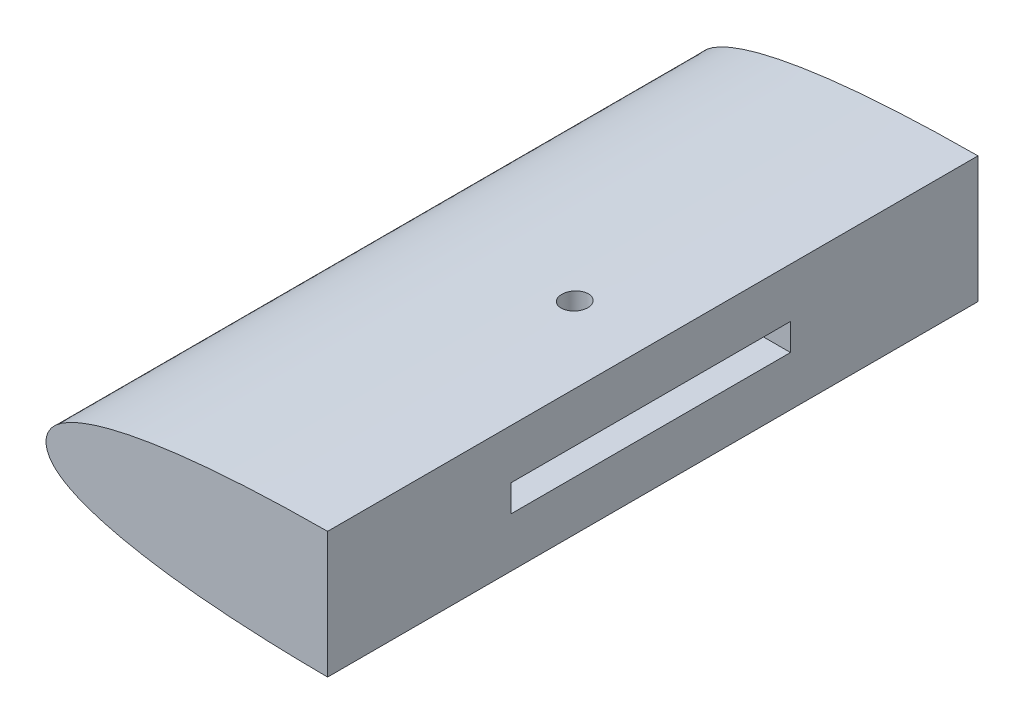
ISO-10303-21;
HEADER;
FILE_DESCRIPTION(('STEP AP214'),'2;1');
FILE_NAME('part.step','',(''),(''),'','','');
FILE_SCHEMA(('AUTOMOTIVE_DESIGN { 1 0 10303 214 1 1 1 1 }'));
ENDSEC;
DATA;
#1=APPLICATION_CONTEXT('core data for automotive mechanical design processes');
#2=APPLICATION_PROTOCOL_DEFINITION('international standard','automotive_design',2000,#1);
#3=PRODUCT_CONTEXT('',#1,'mechanical');
#4=PRODUCT('Part','Part','',(#3));
#5=PRODUCT_RELATED_PRODUCT_CATEGORY('part','',(#4));
#6=PRODUCT_DEFINITION_FORMATION('','',#4);
#7=PRODUCT_DEFINITION_CONTEXT('part definition',#1,'design');
#8=PRODUCT_DEFINITION('design','',#6,#7);
#9=PRODUCT_DEFINITION_SHAPE('','',#8);
#10=(LENGTH_UNIT() NAMED_UNIT(*) SI_UNIT(.MILLI.,.METRE.));
#11=(NAMED_UNIT(*) PLANE_ANGLE_UNIT() SI_UNIT($,.RADIAN.));
#12=(NAMED_UNIT(*) SI_UNIT($,.STERADIAN.) SOLID_ANGLE_UNIT());
#13=UNCERTAINTY_MEASURE_WITH_UNIT(LENGTH_MEASURE(1.E-05),#10,'distance_accuracy_value','');
#14=(GEOMETRIC_REPRESENTATION_CONTEXT(3) GLOBAL_UNCERTAINTY_ASSIGNED_CONTEXT((#13)) GLOBAL_UNIT_ASSIGNED_CONTEXT((#10,
#11,#12)) REPRESENTATION_CONTEXT('',''));
#15=CARTESIAN_POINT('',(0.,0.,0.));
#16=DIRECTION('',(0.,0.,1.));
#17=DIRECTION('',(1.,0.,0.));
#18=AXIS2_PLACEMENT_3D('',#15,#16,#17);
#19=CARTESIAN_POINT('',(30.9490601417906,3.10353900169913,106.75));
#20=DIRECTION('',(0.,1.,0.));
#21=DIRECTION('',(0.,0.,1.));
#22=AXIS2_PLACEMENT_3D('',#19,#20,#21);
#23=PLANE('',#22);
#24=CARTESIAN_POINT('',(46.9490601417906,3.10353900169913,75.));
#25=DIRECTION('',(0.,1.,0.));
#26=DIRECTION('',(0.,0.,1.));
#27=AXIS2_PLACEMENT_3D('',#24,#25,#26);
#28=CIRCLE('',#27,3.);
#29=CARTESIAN_POINT('',(46.9490601417906,3.10353900169913,78.));
#30=VERTEX_POINT('',#29);
#31=EDGE_CURVE('E140',#30,#30,#28,.T.);
#32=ORIENTED_EDGE('',*,*,#31,.T.);
#33=EDGE_LOOP('',(#32));
#34=FACE_BOUND('',#33,.T.);
#35=DIRECTION('',(0.,0.,1.));
#36=VECTOR('',#35,1.);
#37=CARTESIAN_POINT('',(64.9490601417906,3.10353900169913,106.75));
#38=LINE('',#37,#36);
#39=CARTESIAN_POINT('',(64.9490601417906,3.10353900169913,43.25));
#40=VERTEX_POINT('',#39);
#41=CARTESIAN_POINT('',(64.9490601417906,3.10353900169913,107.75));
#42=VERTEX_POINT('',#41);
#43=EDGE_CURVE('E154',#40,#42,#38,.T.);
#44=ORIENTED_EDGE('',*,*,#43,.T.);
#45=DIRECTION('',(1.,0.,0.));
#46=VECTOR('',#45,1.);
#47=CARTESIAN_POINT('',(64.9490601417906,3.10353900169913,107.75));
#48=LINE('',#47,#46);
#49=CARTESIAN_POINT('',(37.9490601417906,3.10353900169913,107.75));
#50=VERTEX_POINT('',#49);
#51=EDGE_CURVE('E127',#50,#42,#48,.T.);
#52=ORIENTED_EDGE('',*,*,#51,.F.);
#53=DIRECTION('',(0.,0.,1.));
#54=VECTOR('',#53,1.);
#55=CARTESIAN_POINT('',(37.9490601417906,3.10353900169913,106.75));
#56=LINE('',#55,#54);
#57=CARTESIAN_POINT('',(37.9490601417906,3.10353900169913,43.25));
#58=VERTEX_POINT('',#57);
#59=EDGE_CURVE('E111',#58,#50,#56,.T.);
#60=ORIENTED_EDGE('',*,*,#59,.F.);
#61=DIRECTION('',(1.,0.,0.));
#62=VECTOR('',#61,1.);
#63=CARTESIAN_POINT('',(30.9490601417906,3.10353900169913,43.25));
#64=LINE('',#63,#62);
#65=EDGE_CURVE('E158',#58,#40,#64,.T.);
#66=ORIENTED_EDGE('',*,*,#65,.T.);
#67=EDGE_LOOP('',(#44,#52,#60,#66));
#68=FACE_BOUND('',#67,.T.);
#69=ADVANCED_FACE('F42',(#34,#68),#23,.F.);
#70=CARTESIAN_POINT('',(30.9490601417906,3.10353900169913,43.25));
#71=DIRECTION('',(0.,0.,-1.));
#72=DIRECTION('',(-1.,0.,0.));
#73=AXIS2_PLACEMENT_3D('',#70,#71,#72);
#74=PLANE('',#73);
#75=ORIENTED_EDGE('',*,*,#65,.F.);
#76=DIRECTION('',(0.,1.,0.));
#77=VECTOR('',#76,1.);
#78=CARTESIAN_POINT('',(37.9490601417906,3.10353900169913,43.25));
#79=LINE('',#78,#77);
#80=CARTESIAN_POINT('',(37.9490601417906,-3.10353900169913,43.25));
#81=VERTEX_POINT('',#80);
#82=EDGE_CURVE('E146',#81,#58,#79,.T.);
#83=ORIENTED_EDGE('',*,*,#82,.F.);
#84=DIRECTION('',(1.,0.,0.));
#85=VECTOR('',#84,1.);
#86=CARTESIAN_POINT('',(30.9490601417906,-3.10353900169913,43.25));
#87=LINE('',#86,#85);
#88=CARTESIAN_POINT('',(64.9490601417906,-3.10353900169913,43.25));
#89=VERTEX_POINT('',#88);
#90=EDGE_CURVE('E157',#81,#89,#87,.T.);
#91=ORIENTED_EDGE('',*,*,#90,.T.);
#92=DIRECTION('',(0.,1.,0.));
#93=VECTOR('',#92,1.);
#94=CARTESIAN_POINT('',(64.9490601417906,3.10353900169913,43.25));
#95=LINE('',#94,#93);
#96=EDGE_CURVE('E108',#89,#40,#95,.T.);
#97=ORIENTED_EDGE('',*,*,#96,.T.);
#98=EDGE_LOOP('',(#75,#83,#91,#97));
#99=FACE_BOUND('',#98,.T.);
#100=ADVANCED_FACE('F203',(#99),#74,.F.);
#101=CARTESIAN_POINT('',(30.9490601417906,-3.10353900169913,106.75));
#102=DIRECTION('',(0.,-1.,0.));
#103=DIRECTION('',(0.,0.,-1.));
#104=AXIS2_PLACEMENT_3D('',#101,#102,#103);
#105=PLANE('',#104);
#106=CARTESIAN_POINT('',(46.9490601417906,-3.10353900169913,75.));
#107=DIRECTION('',(0.,-1.,0.));
#108=DIRECTION('',(0.,0.,-1.));
#109=AXIS2_PLACEMENT_3D('',#106,#107,#108);
#110=CIRCLE('',#109,3.);
#111=CARTESIAN_POINT('',(46.9490601417906,-3.10353900169913,72.));
#112=VERTEX_POINT('',#111);
#113=EDGE_CURVE('E136',#112,#112,#110,.T.);
#114=ORIENTED_EDGE('',*,*,#113,.T.);
#115=EDGE_LOOP('',(#114));
#116=FACE_BOUND('',#115,.T.);
#117=ORIENTED_EDGE('',*,*,#90,.F.);
#118=DIRECTION('',(0.,0.,-1.));
#119=VECTOR('',#118,1.);
#120=CARTESIAN_POINT('',(37.9490601417906,-3.10353900169913,106.75));
#121=LINE('',#120,#119);
#122=CARTESIAN_POINT('',(37.9490601417906,-3.10353900169913,107.75));
#123=VERTEX_POINT('',#122);
#124=EDGE_CURVE('E117',#123,#81,#121,.T.);
#125=ORIENTED_EDGE('',*,*,#124,.F.);
#126=DIRECTION('',(-1.,0.,0.));
#127=VECTOR('',#126,1.);
#128=CARTESIAN_POINT('',(64.9490601417906,-3.10353900169913,107.75));
#129=LINE('',#128,#127);
#130=CARTESIAN_POINT('',(64.9490601417906,-3.10353900169913,107.75));
#131=VERTEX_POINT('',#130);
#132=EDGE_CURVE('E114',#131,#123,#129,.T.);
#133=ORIENTED_EDGE('',*,*,#132,.F.);
#134=DIRECTION('',(0.,0.,-1.));
#135=VECTOR('',#134,1.);
#136=CARTESIAN_POINT('',(64.9490601417906,-3.10353900169913,106.75));
#137=LINE('',#136,#135);
#138=EDGE_CURVE('E101',#131,#89,#137,.T.);
#139=ORIENTED_EDGE('',*,*,#138,.T.);
#140=EDGE_LOOP('',(#117,#125,#133,#139));
#141=FACE_BOUND('',#140,.T.);
#142=ADVANCED_FACE('F115',(#116,#141),#105,.F.);
#143=CARTESIAN_POINT('',(64.9490601417906,14.5585390016991,150.01));
#144=DIRECTION('',(1.,0.,0.));
#145=DIRECTION('',(0.,0.,-1.));
#146=AXIS2_PLACEMENT_3D('',#143,#144,#145);
#147=PLANE('',#146);
#148=DIRECTION('',(0.,-1.,0.));
#149=VECTOR('',#148,1.);
#150=CARTESIAN_POINT('',(64.9490601417906,-3.10353900169913,107.75));
#151=LINE('',#150,#149);
#152=EDGE_CURVE('E106',#42,#131,#151,.T.);
#153=ORIENTED_EDGE('',*,*,#152,.F.);
#154=ORIENTED_EDGE('',*,*,#43,.F.);
#155=ORIENTED_EDGE('',*,*,#96,.F.);
#156=ORIENTED_EDGE('',*,*,#138,.F.);
#157=EDGE_LOOP('',(#153,#154,#155,#156));
#158=FACE_BOUND('',#157,.T.);
#159=DIRECTION('',(0.,1.,0.));
#160=VECTOR('',#159,1.);
#161=CARTESIAN_POINT('',(64.9490601417906,2.03901631355602E-13,150.));
#162=LINE('',#161,#160);
#163=CARTESIAN_POINT('',(64.9490601417907,-14.5585390016991,150.));
#164=VERTEX_POINT('',#163);
#165=CARTESIAN_POINT('',(64.9490601417906,14.5585390016991,150.));
#166=VERTEX_POINT('',#165);
#167=EDGE_CURVE('E63',#164,#166,#162,.T.);
#168=ORIENTED_EDGE('',*,*,#167,.F.);
#169=DIRECTION('',(0.,0.,-1.));
#170=VECTOR('',#169,1.);
#171=CARTESIAN_POINT('',(64.9490601417906,-14.5585390016991,150.));
#172=LINE('',#171,#170);
#173=CARTESIAN_POINT('',(64.9490601417907,-14.5585390016991,0.));
#174=VERTEX_POINT('',#173);
#175=EDGE_CURVE('E223',#164,#174,#172,.T.);
#176=ORIENTED_EDGE('',*,*,#175,.T.);
#177=DIRECTION('',(0.,1.,0.));
#178=VECTOR('',#177,1.);
#179=CARTESIAN_POINT('',(64.9490601417906,2.03901631355602E-13,0.));
#180=LINE('',#179,#178);
#181=CARTESIAN_POINT('',(64.9490601417906,14.5585390016991,0.));
#182=VERTEX_POINT('',#181);
#183=EDGE_CURVE('E161',#174,#182,#180,.T.);
#184=ORIENTED_EDGE('',*,*,#183,.T.);
#185=DIRECTION('',(0.,0.,-1.));
#186=VECTOR('',#185,1.);
#187=CARTESIAN_POINT('',(64.9490601417906,14.5585390016991,150.));
#188=LINE('',#187,#186);
#189=EDGE_CURVE('E221',#182,#166,#188,.F.);
#190=ORIENTED_EDGE('',*,*,#189,.T.);
#191=EDGE_LOOP('',(#168,#176,#184,#190));
#192=FACE_BOUND('',#191,.T.);
#193=ADVANCED_FACE('F103',(#158,#192),#147,.T.);
#194=CARTESIAN_POINT('',(0.,2.03901631355602E-13,0.));
#195=DIRECTION('',(0.,0.,1.));
#196=DIRECTION('',(1.,0.,0.));
#197=AXIS2_PLACEMENT_3D('',#194,#195,#196);
#198=PLANE('',#197);
#199=ORIENTED_EDGE('',*,*,#183,.F.);
#200=CARTESIAN_POINT('',(300.,0.615,0.));
#201=CARTESIAN_POINT('',(297.904984083785,0.75175754308859,0.));
#202=CARTESIAN_POINT('',(292.317834146917,1.11647310076999,0.));
#203=CARTESIAN_POINT('',(283.239167485548,1.717548993117,0.));
#204=CARTESIAN_POINT('',(272.76385107331,2.40173412883395,0.));
#205=CARTESIAN_POINT('',(262.289009769235,3.09314837150869,0.));
#206=CARTESIAN_POINT('',(251.814135815064,3.78406655140474,0.));
#207=CARTESIAN_POINT('',(241.337843931188,4.46862529985887,0.));
#208=CARTESIAN_POINT('',(230.862161265605,5.16145375899976,0.));
#209=CARTESIAN_POINT('',(220.385838201456,5.84553816170969,0.));
#210=CARTESIAN_POINT('',(209.911154414138,6.53834924156426,0.));
#211=CARTESIAN_POINT('',(199.435845553229,7.22265025326787,0.));
#212=CARTESIAN_POINT('',(188.961161961777,7.91546436518573,0.));
#213=CARTESIAN_POINT('',(178.484838114123,8.59953663901671,0.));
#214=CARTESIAN_POINT('',(168.010154067309,9.29234472619852,0.));
#215=CARTESIAN_POINT('',(157.534847027507,9.97666983236351,0.));
#216=CARTESIAN_POINT('',(147.06015640951,10.6693905377389,0.));
#217=CARTESIAN_POINT('',(136.583858847943,11.3538123568298,0.));
#218=CARTESIAN_POINT('',(126.108081002565,12.0453815229781,0.));
#219=CARTESIAN_POINT('',(115.628989204461,12.7348475775842,0.));
#220=CARTESIAN_POINT('',(106.544413863488,13.3187717638727,0.));
#221=CARTESIAN_POINT('',(98.151476206991,13.7592616634662,0.));
#222=CARTESIAN_POINT('',(91.1565623688358,14.0750535449349,0.));
#223=CARTESIAN_POINT('',(83.4590911030426,14.3326710084469,0.));
#224=CARTESIAN_POINT('',(76.8097627687469,14.4942663264378,0.));
#225=CARTESIAN_POINT('',(71.208103954924,14.5530438963208,0.));
#226=CARTESIAN_POINT('',(68.0570107705436,14.5648415354949,0.));
#227=CARTESIAN_POINT('',(65.9559846118634,14.5661361460291,0.));
#228=CARTESIAN_POINT('',(63.5049428575731,14.5483076615896,0.));
#229=CARTESIAN_POINT('',(58.9501852432483,14.5072274097355,0.));
#230=CARTESIAN_POINT('',(52.6393729328738,14.3421780252763,0.));
#231=CARTESIAN_POINT('',(45.9763950033585,14.0411696911552,0.));
#232=CARTESIAN_POINT('',(40.7142788662388,13.6942708963401,0.));
#233=CARTESIAN_POINT('',(36.8531486122309,13.3715858694841,0.));
#234=CARTESIAN_POINT('',(33.6905280026766,13.0667563353647,0.));
#235=CARTESIAN_POINT('',(30.5256864431676,12.7135928826588,0.));
#236=CARTESIAN_POINT('',(27.3574246256501,12.304603807145,0.));
#237=CARTESIAN_POINT('',(23.8293477768756,11.7731450606675,0.));
#238=CARTESIAN_POINT('',(20.2934490427705,11.1558108117877,0.));
#239=CARTESIAN_POINT('',(16.7526134925339,10.4050388087684,0.));
#240=CARTESIAN_POINT('',(13.9101456800867,9.69526837778904,0.));
#241=CARTESIAN_POINT('',(11.411898728501,8.96894267593932,0.));
#242=CARTESIAN_POINT('',(9.247069544107,8.23912232844403,0.));
#243=CARTESIAN_POINT('',(7.0471016636079,7.37156353291515,0.));
#244=CARTESIAN_POINT('',(5.20436825337569,6.46929823591286,0.));
#245=CARTESIAN_POINT('',(3.70440686726622,5.56696021824286,0.));
#246=CARTESIAN_POINT('',(2.49240630636274,4.6717641181702,0.));
#247=CARTESIAN_POINT('',(0.823776107687222,3.08438944362807,0.));
#248=CARTESIAN_POINT('',(-0.563560510684523,0.,0.));
#249=CARTESIAN_POINT('',(0.823776107687273,-3.08438944362815,0.));
#250=CARTESIAN_POINT('',(2.49240630636272,-4.67176411817019,0.));
#251=CARTESIAN_POINT('',(3.70440686726622,-5.56696021824286,0.));
#252=CARTESIAN_POINT('',(5.20436825337569,-6.46929823591286,0.));
#253=CARTESIAN_POINT('',(7.04710166360792,-7.37156353291516,0.));
#254=CARTESIAN_POINT('',(9.24706954410698,-8.23912232844402,0.));
#255=CARTESIAN_POINT('',(11.411898728501,-8.96894267593932,0.));
#256=CARTESIAN_POINT('',(13.9101456800867,-9.69526837778906,0.));
#257=CARTESIAN_POINT('',(16.7526134925338,-10.4050388087684,0.));
#258=CARTESIAN_POINT('',(20.2934490427705,-11.1558108117877,0.));
#259=CARTESIAN_POINT('',(23.8293477768757,-11.7731450606675,0.));
#260=CARTESIAN_POINT('',(27.35742462565,-12.304603807145,0.));
#261=CARTESIAN_POINT('',(30.5256864431676,-12.7135928826588,0.));
#262=CARTESIAN_POINT('',(33.6905280026766,-13.0667563353647,0.));
#263=CARTESIAN_POINT('',(36.8531486122309,-13.3715858694841,0.));
#264=CARTESIAN_POINT('',(40.7142788662388,-13.6942708963401,0.));
#265=CARTESIAN_POINT('',(45.9763950033586,-14.0411696911552,0.));
#266=CARTESIAN_POINT('',(52.6393729328738,-14.3421780252763,0.));
#267=CARTESIAN_POINT('',(58.9501852432483,-14.5072274097355,0.));
#268=CARTESIAN_POINT('',(63.5049428575731,-14.5483076615896,0.));
#269=CARTESIAN_POINT('',(65.9559846118633,-14.5661361460291,0.));
#270=CARTESIAN_POINT('',(68.0570107705436,-14.5648415354949,0.));
#271=CARTESIAN_POINT('',(71.208103954924,-14.5530438963208,0.));
#272=CARTESIAN_POINT('',(76.8097627687469,-14.4942663264378,0.));
#273=CARTESIAN_POINT('',(83.4590911030426,-14.3326710084469,0.));
#274=CARTESIAN_POINT('',(91.1565623688358,-14.0750535449349,0.));
#275=CARTESIAN_POINT('',(98.151476206991,-13.7592616634662,0.));
#276=CARTESIAN_POINT('',(106.544413863488,-13.3187717638727,0.));
#277=CARTESIAN_POINT('',(115.628989204461,-12.7348475775842,0.));
#278=CARTESIAN_POINT('',(126.108081002565,-12.0453815229782,0.));
#279=CARTESIAN_POINT('',(136.583858847943,-11.3538123568298,0.));
#280=CARTESIAN_POINT('',(147.06015640951,-10.6693905377389,0.));
#281=CARTESIAN_POINT('',(157.534847027507,-9.97666983236352,0.));
#282=CARTESIAN_POINT('',(168.010154067309,-9.29234472619851,0.));
#283=CARTESIAN_POINT('',(178.484838114123,-8.59953663901672,0.));
#284=CARTESIAN_POINT('',(188.961161961777,-7.91546436518573,0.));
#285=CARTESIAN_POINT('',(199.435845553229,-7.22265025326786,0.));
#286=CARTESIAN_POINT('',(209.911154414138,-6.53834924156426,0.));
#287=CARTESIAN_POINT('',(220.385838201456,-5.84553816170969,0.));
#288=CARTESIAN_POINT('',(230.862161265605,-5.16145375899976,0.));
#289=CARTESIAN_POINT('',(241.337843931188,-4.46862529985887,0.));
#290=CARTESIAN_POINT('',(251.814135815064,-3.78406655140474,0.));
#291=CARTESIAN_POINT('',(262.289009769236,-3.09314837150869,0.));
#292=CARTESIAN_POINT('',(272.76385107331,-2.40173412883395,0.));
#293=CARTESIAN_POINT('',(283.239167485548,-1.71754899311699,0.));
#294=CARTESIAN_POINT('',(292.317834146917,-1.11647310077,0.));
#295=CARTESIAN_POINT('',(297.904984083785,-0.75175754308859,0.));
#296=CARTESIAN_POINT('',(300.,-0.615,0.));
#297=B_SPLINE_CURVE_WITH_KNOTS('',3,(#200,#201,#202,#203,#204,#205,#206,#207,#208,#209,#210,
#211,#212,#213,#214,#215,#216,#217,#218,#219,#220,#221,#222,#223,#224,#225,#226,#227,#228,#229,
#230,#231,#232,#233,#234,#235,#236,#237,#238,#239,#240,#241,#242,#243,#244,#245,#246,#247,#248,
#249,#250,#251,#252,#253,#254,#255,#256,#257,#258,#259,#260,#261,#262,#263,#264,#265,#266,#267,
#268,#269,#270,#271,#272,#273,#274,#275,#276,#277,#278,#279,#280,#281,#282,#283,#284,#285,#286,
#287,#288,#289,#290,#291,#292,#293,#294,#295,#296),.UNSPECIFIED.,.F.,.F.,(4,1,1,1,1,1,1,1,1,1,1,
1,1,1,1,1,1,1,1,1,1,1,1,1,1,1,1,1,1,1,1,1,1,1,1,1,1,1,1,1,1,1,1,1,1,1,1,1,1,1,1,1,1,1,1,1,1,1,1,
1,1,1,1,1,1,1,1,1,1,1,1,1,1,1,1,1,1,1,1,1,1,1,1,1,1,1,1,1,1,1,1,1,1,1,4),(0.,0.0103317667258092,
0.0275535519148415,0.0447750143759933,0.0619918890878921,0.0792136742769245,0.0964351367380763,
0.113656921927109,0.13087838438826,0.148100169577293,0.165316721469263,0.182538506658296,
0.199759969119447,0.21698175430848,0.23419830620045,0.251420091389483,0.268641553850634,
0.285863339039667,0.303084801500818,0.320322147091687,0.330661096781363,0.344443905301423,
0.354779243630488,0.368562091684667,0.377174559088726,0.382346693571461,0.384069085539591,
0.387513925716762,0.394408809862741,0.406484297575228,0.418578438098915,0.427229264414947,
0.432434171748687,0.437645263639366,0.442864528340028,0.448104781667718,0.453364927121588,
0.460421620890769,0.465764878525566,0.47117403778509,0.474835155867093,0.478565393973049,
0.482412614605373,0.486466494475071,0.488643966308192,0.49102188077919,0.493857902158305,0.5,
0.506142097841696,0.50897811922081,0.511356033691808,0.513533505524929,0.517587385394628,
0.521434606026952,0.525164844132907,0.52882596221491,0.534235121474435,0.539578379109231,
0.546635072878412,0.551895218332282,0.557135471659973,0.562354736360635,0.567565828251314,
0.572770735585054,0.581421561901085,0.593515702424773,0.605591190137259,0.612486074283239,
0.615930914460409,0.617653306428539,0.622825440911274,0.631437908315334,0.645220756369513,
0.655556094698577,0.669338903218637,0.679677852908314,0.696915198499182,0.714136660960334,
0.731358446149366,0.748579908610518,0.76580169379955,0.783018245691521,0.800240030880553,
0.817461493341705,0.834683278530737,0.851899830422708,0.86912161561174,0.886343078072892,
0.903564863261924,0.920786325723076,0.938008110912108,0.955224985624007,0.972446448085159,
0.989668233274191,1.),.UNSPECIFIED.);
#298=EDGE_CURVE('E12',#182,#174,#297,.T.);
#299=ORIENTED_EDGE('',*,*,#298,.F.);
#300=EDGE_LOOP('',(#199,#299));
#301=FACE_BOUND('',#300,.T.);
#302=ADVANCED_FACE('F177',(#301),#198,.F.);
#303=CARTESIAN_POINT('',(300.,0.615,150.));
#304=CARTESIAN_POINT('',(297.904984083785,0.75175754308859,150.));
#305=CARTESIAN_POINT('',(292.317834146917,1.11647310076999,150.));
#306=CARTESIAN_POINT('',(283.239167485548,1.717548993117,150.));
#307=CARTESIAN_POINT('',(272.76385107331,2.40173412883395,150.));
#308=CARTESIAN_POINT('',(262.289009769235,3.09314837150869,150.));
#309=CARTESIAN_POINT('',(251.814135815064,3.78406655140474,150.));
#310=CARTESIAN_POINT('',(241.337843931188,4.46862529985887,150.));
#311=CARTESIAN_POINT('',(230.862161265605,5.16145375899976,150.));
#312=CARTESIAN_POINT('',(220.385838201456,5.84553816170969,150.));
#313=CARTESIAN_POINT('',(209.911154414138,6.53834924156426,150.));
#314=CARTESIAN_POINT('',(199.435845553229,7.22265025326787,150.));
#315=CARTESIAN_POINT('',(188.961161961777,7.91546436518573,150.));
#316=CARTESIAN_POINT('',(178.484838114123,8.59953663901671,150.));
#317=CARTESIAN_POINT('',(168.010154067309,9.29234472619852,150.));
#318=CARTESIAN_POINT('',(157.534847027507,9.97666983236351,150.));
#319=CARTESIAN_POINT('',(147.06015640951,10.6693905377389,150.));
#320=CARTESIAN_POINT('',(136.583858847943,11.3538123568298,150.));
#321=CARTESIAN_POINT('',(126.108081002565,12.0453815229781,150.));
#322=CARTESIAN_POINT('',(115.628989204461,12.7348475775842,150.));
#323=CARTESIAN_POINT('',(106.544413863488,13.3187717638727,150.));
#324=CARTESIAN_POINT('',(98.151476206991,13.7592616634662,150.));
#325=CARTESIAN_POINT('',(91.1565623688358,14.0750535449349,150.));
#326=CARTESIAN_POINT('',(83.4590911030426,14.3326710084469,150.));
#327=CARTESIAN_POINT('',(76.8097627687469,14.4942663264378,150.));
#328=CARTESIAN_POINT('',(71.208103954924,14.5530438963208,150.));
#329=CARTESIAN_POINT('',(68.0570107705436,14.5648415354949,150.));
#330=CARTESIAN_POINT('',(65.9559846118634,14.5661361460291,150.));
#331=CARTESIAN_POINT('',(63.5049428575731,14.5483076615896,150.));
#332=CARTESIAN_POINT('',(58.9501852432483,14.5072274097355,150.));
#333=CARTESIAN_POINT('',(52.6393729328738,14.3421780252763,150.));
#334=CARTESIAN_POINT('',(45.9763950033585,14.0411696911552,150.));
#335=CARTESIAN_POINT('',(40.7142788662388,13.6942708963401,150.));
#336=CARTESIAN_POINT('',(36.8531486122309,13.3715858694841,150.));
#337=CARTESIAN_POINT('',(33.6905280026766,13.0667563353647,150.));
#338=CARTESIAN_POINT('',(30.5256864431676,12.7135928826588,150.));
#339=CARTESIAN_POINT('',(27.3574246256501,12.304603807145,150.));
#340=CARTESIAN_POINT('',(23.8293477768756,11.7731450606675,150.));
#341=CARTESIAN_POINT('',(20.2934490427705,11.1558108117877,150.));
#342=CARTESIAN_POINT('',(16.7526134925339,10.4050388087684,150.));
#343=CARTESIAN_POINT('',(13.9101456800867,9.69526837778904,150.));
#344=CARTESIAN_POINT('',(11.411898728501,8.96894267593932,150.));
#345=CARTESIAN_POINT('',(9.247069544107,8.23912232844403,150.));
#346=CARTESIAN_POINT('',(7.0471016636079,7.37156353291515,150.));
#347=CARTESIAN_POINT('',(5.20436825337569,6.46929823591286,150.));
#348=CARTESIAN_POINT('',(3.70440686726622,5.56696021824286,150.));
#349=CARTESIAN_POINT('',(2.49240630636274,4.6717641181702,150.));
#350=CARTESIAN_POINT('',(0.823776107687222,3.08438944362807,150.));
#351=CARTESIAN_POINT('',(-0.563560510684523,0.,150.));
#352=CARTESIAN_POINT('',(0.823776107687273,-3.08438944362815,150.));
#353=CARTESIAN_POINT('',(2.49240630636272,-4.67176411817019,150.));
#354=CARTESIAN_POINT('',(3.70440686726622,-5.56696021824286,150.));
#355=CARTESIAN_POINT('',(5.20436825337569,-6.46929823591286,150.));
#356=CARTESIAN_POINT('',(7.04710166360792,-7.37156353291516,150.));
#357=CARTESIAN_POINT('',(9.24706954410698,-8.23912232844402,150.));
#358=CARTESIAN_POINT('',(11.411898728501,-8.96894267593932,150.));
#359=CARTESIAN_POINT('',(13.9101456800867,-9.69526837778906,150.));
#360=CARTESIAN_POINT('',(16.7526134925338,-10.4050388087684,150.));
#361=CARTESIAN_POINT('',(20.2934490427705,-11.1558108117877,150.));
#362=CARTESIAN_POINT('',(23.8293477768757,-11.7731450606675,150.));
#363=CARTESIAN_POINT('',(27.35742462565,-12.304603807145,150.));
#364=CARTESIAN_POINT('',(30.5256864431676,-12.7135928826588,150.));
#365=CARTESIAN_POINT('',(33.6905280026766,-13.0667563353647,150.));
#366=CARTESIAN_POINT('',(36.8531486122309,-13.3715858694841,150.));
#367=CARTESIAN_POINT('',(40.7142788662388,-13.6942708963401,150.));
#368=CARTESIAN_POINT('',(45.9763950033586,-14.0411696911552,150.));
#369=CARTESIAN_POINT('',(52.6393729328738,-14.3421780252763,150.));
#370=CARTESIAN_POINT('',(58.9501852432483,-14.5072274097355,150.));
#371=CARTESIAN_POINT('',(63.5049428575731,-14.5483076615896,150.));
#372=CARTESIAN_POINT('',(65.9559846118633,-14.5661361460291,150.));
#373=CARTESIAN_POINT('',(68.0570107705436,-14.5648415354949,150.));
#374=CARTESIAN_POINT('',(71.208103954924,-14.5530438963208,150.));
#375=CARTESIAN_POINT('',(76.8097627687469,-14.4942663264378,150.));
#376=CARTESIAN_POINT('',(83.4590911030426,-14.3326710084469,150.));
#377=CARTESIAN_POINT('',(91.1565623688358,-14.0750535449349,150.));
#378=CARTESIAN_POINT('',(98.151476206991,-13.7592616634662,150.));
#379=CARTESIAN_POINT('',(106.544413863488,-13.3187717638727,150.));
#380=CARTESIAN_POINT('',(115.628989204461,-12.7348475775842,150.));
#381=CARTESIAN_POINT('',(126.108081002565,-12.0453815229782,150.));
#382=CARTESIAN_POINT('',(136.583858847943,-11.3538123568298,150.));
#383=CARTESIAN_POINT('',(147.06015640951,-10.6693905377389,150.));
#384=CARTESIAN_POINT('',(157.534847027507,-9.97666983236352,150.));
#385=CARTESIAN_POINT('',(168.010154067309,-9.29234472619851,150.));
#386=CARTESIAN_POINT('',(178.484838114123,-8.59953663901672,150.));
#387=CARTESIAN_POINT('',(188.961161961777,-7.91546436518573,150.));
#388=CARTESIAN_POINT('',(199.435845553229,-7.22265025326786,150.));
#389=CARTESIAN_POINT('',(209.911154414138,-6.53834924156426,150.));
#390=CARTESIAN_POINT('',(220.385838201456,-5.84553816170969,150.));
#391=CARTESIAN_POINT('',(230.862161265605,-5.16145375899976,150.));
#392=CARTESIAN_POINT('',(241.337843931188,-4.46862529985887,150.));
#393=CARTESIAN_POINT('',(251.814135815064,-3.78406655140474,150.));
#394=CARTESIAN_POINT('',(262.289009769236,-3.09314837150869,150.));
#395=CARTESIAN_POINT('',(272.76385107331,-2.40173412883395,150.));
#396=CARTESIAN_POINT('',(283.239167485548,-1.71754899311699,150.));
#397=CARTESIAN_POINT('',(292.317834146917,-1.11647310077,150.));
#398=CARTESIAN_POINT('',(297.904984083785,-0.75175754308859,150.));
#399=CARTESIAN_POINT('',(300.,-0.615,150.));
#400=B_SPLINE_CURVE_WITH_KNOTS('',3,(#303,#304,#305,#306,#307,#308,#309,#310,#311,#312,#313,
#314,#315,#316,#317,#318,#319,#320,#321,#322,#323,#324,#325,#326,#327,#328,#329,#330,#331,#332,
#333,#334,#335,#336,#337,#338,#339,#340,#341,#342,#343,#344,#345,#346,#347,#348,#349,#350,#351,
#352,#353,#354,#355,#356,#357,#358,#359,#360,#361,#362,#363,#364,#365,#366,#367,#368,#369,#370,
#371,#372,#373,#374,#375,#376,#377,#378,#379,#380,#381,#382,#383,#384,#385,#386,#387,#388,#389,
#390,#391,#392,#393,#394,#395,#396,#397,#398,#399),.UNSPECIFIED.,.F.,.F.,(4,1,1,1,1,1,1,1,1,1,1,
1,1,1,1,1,1,1,1,1,1,1,1,1,1,1,1,1,1,1,1,1,1,1,1,1,1,1,1,1,1,1,1,1,1,1,1,1,1,1,1,1,1,1,1,1,1,1,1,
1,1,1,1,1,1,1,1,1,1,1,1,1,1,1,1,1,1,1,1,1,1,1,1,1,1,1,1,1,1,1,1,1,1,1,4),(0.,0.0103317667258092,
0.0275535519148415,0.0447750143759933,0.0619918890878921,0.0792136742769245,0.0964351367380763,
0.113656921927109,0.13087838438826,0.148100169577293,0.165316721469263,0.182538506658296,
0.199759969119447,0.21698175430848,0.23419830620045,0.251420091389483,0.268641553850634,
0.285863339039667,0.303084801500818,0.320322147091687,0.330661096781363,0.344443905301423,
0.354779243630488,0.368562091684667,0.377174559088726,0.382346693571461,0.384069085539591,
0.387513925716762,0.394408809862741,0.406484297575228,0.418578438098915,0.427229264414947,
0.432434171748687,0.437645263639366,0.442864528340028,0.448104781667718,0.453364927121588,
0.460421620890769,0.465764878525566,0.47117403778509,0.474835155867093,0.478565393973049,
0.482412614605373,0.486466494475071,0.488643966308192,0.49102188077919,0.493857902158305,0.5,
0.506142097841696,0.50897811922081,0.511356033691808,0.513533505524929,0.517587385394628,
0.521434606026952,0.525164844132907,0.52882596221491,0.534235121474435,0.539578379109231,
0.546635072878412,0.551895218332282,0.557135471659973,0.562354736360635,0.567565828251314,
0.572770735585054,0.581421561901085,0.593515702424773,0.605591190137259,0.612486074283239,
0.615930914460409,0.617653306428539,0.622825440911274,0.631437908315334,0.645220756369513,
0.655556094698577,0.669338903218637,0.679677852908314,0.696915198499182,0.714136660960334,
0.731358446149366,0.748579908610518,0.76580169379955,0.783018245691521,0.800240030880553,
0.817461493341705,0.834683278530737,0.851899830422708,0.86912161561174,0.886343078072892,
0.903564863261924,0.920786325723076,0.938008110912108,0.955224985624007,0.972446448085159,
0.989668233274191,1.),.UNSPECIFIED.);
#401=DIRECTION('',(0.,0.,-1.));
#402=VECTOR('',#401,1.);
#403=SURFACE_OF_LINEAR_EXTRUSION('',#400,#402);
#404=CARTESIAN_POINT('',(46.9490601417906,-14.0711285614268,78.));
#405=CARTESIAN_POINT('',(47.1176860867755,-14.0798818583987,77.9999925581094));
#406=CARTESIAN_POINT('',(47.2864407894336,-14.0885074421067,77.9857352975402));
#407=CARTESIAN_POINT('',(47.6193193276599,-14.1052673954628,77.9290480526229));
#408=CARTESIAN_POINT('',(47.7834373752457,-14.1134011644597,77.8865843489561));
#409=CARTESIAN_POINT('',(48.1021741949816,-14.1289717698698,77.7746768534883));
#410=CARTESIAN_POINT('',(48.256797085028,-14.1364089091457,77.7052448544769));
#411=CARTESIAN_POINT('',(48.5521590574651,-14.150427405083,77.5413764013468));
#412=CARTESIAN_POINT('',(48.692901602822,-14.1570089753288,77.4469462057254));
#413=CARTESIAN_POINT('',(48.9564537645091,-14.1691891042293,77.2358131688068));
#414=CARTESIAN_POINT('',(49.079274691274,-14.1747882833322,77.1191244832087));
#415=CARTESIAN_POINT('',(49.3035865296712,-14.1849139602743,76.8667378732675));
#416=CARTESIAN_POINT('',(49.4050767197687,-14.1894404218283,76.7310393061537));
#417=CARTESIAN_POINT('',(49.5837222046167,-14.1973478248894,76.4446481800066));
#418=CARTESIAN_POINT('',(49.6609039123254,-14.2007300100358,76.2939721310391));
#419=CARTESIAN_POINT('',(49.7888778346848,-14.2063098380425,75.981781589266));
#420=CARTESIAN_POINT('',(49.8396702282082,-14.2085074889317,75.8202671699337));
#421=CARTESIAN_POINT('',(49.9133847273125,-14.2116896336296,75.4911214088867));
#422=CARTESIAN_POINT('',(49.936328754123,-14.2126750816488,75.3234949855308));
#423=CARTESIAN_POINT('',(49.9537643034114,-14.213424352636,74.9867666398841));
#424=CARTESIAN_POINT('',(49.9482559508905,-14.2131881809711,74.817664724079));
#425=CARTESIAN_POINT('',(49.9089510953523,-14.2114972676818,74.4828462064584));
#426=CARTESIAN_POINT('',(49.875164251838,-14.2100429421602,74.3171284684576));
#427=CARTESIAN_POINT('',(49.7802793249903,-14.2059337043992,73.9937213022745));
#428=CARTESIAN_POINT('',(49.7191812183971,-14.2032787911373,73.8360318809298));
#429=CARTESIAN_POINT('',(49.5714048620176,-14.1968018573361,73.5331293496547));
#430=CARTESIAN_POINT('',(49.4847226819876,-14.1929796574742,73.387918161068));
#431=CARTESIAN_POINT('',(49.2882521236175,-14.1842220021481,73.1141119435349));
#432=CARTESIAN_POINT('',(49.1784636989116,-14.17928654445,72.9855169479321));
#433=CARTESIAN_POINT('',(48.9388293553337,-14.1683763686905,72.7485035464382));
#434=CARTESIAN_POINT('',(48.8089708486303,-14.1624009981036,72.6400978979217));
#435=CARTESIAN_POINT('',(48.5329403663005,-14.1495187913846,72.4466237646381));
#436=CARTESIAN_POINT('',(48.3867683091244,-14.1426119505961,72.3615553965388));
#437=CARTESIAN_POINT('',(48.0821085943191,-14.1279970776402,72.2170784998682));
#438=CARTESIAN_POINT('',(47.9236088419148,-14.120288256077,72.1576955558396));
#439=CARTESIAN_POINT('',(47.5989200055596,-14.1042476193772,72.0663805511753));
#440=CARTESIAN_POINT('',(47.4327308733846,-14.0959158003333,72.0344486627242));
#441=CARTESIAN_POINT('',(47.0971899022714,-14.0788275032676,71.9989083807102));
#442=CARTESIAN_POINT('',(46.9278348332527,-14.0700705751429,71.9953306968233));
#443=CARTESIAN_POINT('',(46.5909389343875,-14.0523817243959,72.0166732927532));
#444=CARTESIAN_POINT('',(46.4233981143024,-14.0434498008327,72.0415937258233));
#445=CARTESIAN_POINT('',(46.0947615879964,-14.0256737073686,72.119253184205));
#446=CARTESIAN_POINT('',(45.9336705314764,-14.0168296041134,72.1720119033075));
#447=CARTESIAN_POINT('',(45.6226324725418,-13.9995243361674,72.3038689968595));
#448=CARTESIAN_POINT('',(45.4726854792244,-13.9910631717892,72.3829673928106));
#449=CARTESIAN_POINT('',(45.1882217711042,-13.9748212284912,72.5652555160953));
#450=CARTESIAN_POINT('',(45.0537025937098,-13.9670403410327,72.668441390576));
#451=CARTESIAN_POINT('',(44.803901577744,-13.952445144762,72.8959944347509));
#452=CARTESIAN_POINT('',(44.6886196427328,-13.9456308311042,73.0203614982537));
#453=CARTESIAN_POINT('',(44.4807140149008,-13.933241905878,73.2865940820193));
#454=CARTESIAN_POINT('',(44.3880636604695,-13.9276658362814,73.428438713055));
#455=CARTESIAN_POINT('',(44.2278999845282,-13.9179698951703,73.7257184863874));
#456=CARTESIAN_POINT('',(44.1603863868956,-13.9138500076599,73.8811534793733));
#457=CARTESIAN_POINT('',(44.0525304384632,-13.9072452219233,74.2009148945976));
#458=CARTESIAN_POINT('',(44.0121415031049,-13.9047575207106,74.3652255463316));
#459=CARTESIAN_POINT('',(43.9595096470282,-13.9015123034222,74.6983111013185));
#460=CARTESIAN_POINT('',(43.9472665337979,-13.9007547755124,74.8670859740289));
#461=CARTESIAN_POINT('',(43.951275800852,-13.9010024950122,75.2040791859756));
#462=CARTESIAN_POINT('',(43.9674918337388,-13.9020054939157,75.3722979605848));
#463=CARTESIAN_POINT('',(44.0278832133905,-13.9057266436759,75.7036196354904));
#464=CARTESIAN_POINT('',(44.0720585700763,-13.908444795141,75.8667225339715));
#465=CARTESIAN_POINT('',(44.18710299088,-13.9154804922205,76.1831907628663));
#466=CARTESIAN_POINT('',(44.2579725131298,-13.9197980652845,76.3365559261057));
#467=CARTESIAN_POINT('',(44.4243768621681,-13.9298527495859,76.6292043191503));
#468=CARTESIAN_POINT('',(44.5199108687711,-13.9355898136198,76.7684880170021));
#469=CARTESIAN_POINT('',(44.7330489917625,-13.9482602235385,77.0292066371249));
#470=CARTESIAN_POINT('',(44.8506787026793,-13.9551949559827,77.1506205661254));
#471=CARTESIAN_POINT('',(45.1046299368109,-13.9699911970914,77.3720154284039));
#472=CARTESIAN_POINT('',(45.240956260448,-13.9778529436972,77.471990840311));
#473=CARTESIAN_POINT('',(45.5287108334387,-13.9942316285456,77.6478510353137));
#474=CARTESIAN_POINT('',(45.6801715819963,-14.0027499673682,77.7236824454475));
#475=CARTESIAN_POINT('',(45.9935388216106,-14.0201250546112,77.8487497702005));
#476=CARTESIAN_POINT('',(46.1554326559749,-14.0289813878705,77.8980172548579));
#477=CARTESIAN_POINT('',(46.4234667262752,-14.0434275791522,77.9554925158245));
#478=CARTESIAN_POINT('',(46.5278691652056,-14.0490031581181,77.9721616726481));
#479=CARTESIAN_POINT('',(46.7378509412862,-14.0601120499516,77.9944177507751));
#480=CARTESIAN_POINT('',(46.8434302795368,-14.0656453627798,78.0000046617137));
#481=CARTESIAN_POINT('',(46.9490601417906,-14.0711285614268,78.));
#482=B_SPLINE_CURVE_WITH_KNOTS('',3,(#404,#405,#406,#407,#408,#409,#410,#411,#412,#413,#414,
#415,#416,#417,#418,#419,#420,#421,#422,#423,#424,#425,#426,#427,#428,#429,#430,#431,#432,#433,
#434,#435,#436,#437,#438,#439,#440,#441,#442,#443,#444,#445,#446,#447,#448,#449,#450,#451,#452,
#453,#454,#455,#456,#457,#458,#459,#460,#461,#462,#463,#464,#465,#466,#467,#468,#469,#470,#471,
#472,#473,#474,#475,#476,#477,#478,#479,#480,#481),.UNSPECIFIED.,.T.,.F.,(4,2,2,2,2,2,2,2,2,2,2,
2,2,2,2,2,2,2,2,2,2,2,2,2,2,2,2,2,2,2,2,2,2,2,2,2,2,2,4),(0.,0.506173327569046,1.01295285035282,
1.51951101587013,2.02594248026446,2.53205293756201,3.03818051182609,3.54375622856746,
4.04932851836095,4.55450258124996,5.05967442473402,5.56467377958159,6.06967356451664,
6.5747509682981,7.07982938560012,7.58522588021889,8.09062490137351,8.59652618372064,
9.10243063926978,9.60888295154289,10.1153379873594,10.6221517887424,11.1289660038515,
11.63569920823,12.1424298721839,12.648560660739,13.1546858893769,13.6599396479953,
14.1651899507644,14.6697954284416,15.1744010851681,15.6790154024593,16.1836129416148,
16.6887986258772,17.1941142620541,17.7005393204143,18.2063611811236,18.5234355724141,
18.8405102602533),.UNSPECIFIED.);
#483=CARTESIAN_POINT('',(46.9490601417906,-14.0711285614268,78.));
#484=VERTEX_POINT('',#483);
#485=EDGE_CURVE('E46',#484,#484,#482,.T.);
#486=ORIENTED_EDGE('',*,*,#485,.T.);
#487=EDGE_LOOP('',(#486));
#488=FACE_BOUND('',#487,.T.);
#489=CARTESIAN_POINT('',(46.9490601417906,14.0711285614268,78.));
#490=CARTESIAN_POINT('',(46.780331850215,14.0623695698295,77.9999925376391));
#491=CARTESIAN_POINT('',(46.6114880549318,14.0534700106628,77.9857178922438));
#492=CARTESIAN_POINT('',(46.2784622621706,14.0356537997252,77.9289751204788));
#493=CARTESIAN_POINT('',(46.1142861476615,14.0267371402976,77.8864729287253));
#494=CARTESIAN_POINT('',(45.7954649348265,14.0091807337635,77.7744799891453));
#495=CARTESIAN_POINT('',(45.6408154506598,14.0005408601238,77.7050017696896));
#496=CARTESIAN_POINT('',(45.3454180723142,13.983832025011,77.5410363061296));
#497=CARTESIAN_POINT('',(45.2046666989482,13.9757629207983,77.4465553429995));
#498=CARTESIAN_POINT('',(44.9410607827463,13.960487660058,77.2352763779863));
#499=CARTESIAN_POINT('',(44.8182011115098,13.9532812563554,77.1184847934008));
#500=CARTESIAN_POINT('',(44.5938358146445,13.9400040163166,76.8658666105602));
#501=CARTESIAN_POINT('',(44.4923308859109,13.9339332170407,76.730039391333));
#502=CARTESIAN_POINT('',(44.3137201662208,13.9231789589127,76.4434178720495));
#503=CARTESIAN_POINT('',(44.236579091927,13.9184934944755,76.2926456350395));
#504=CARTESIAN_POINT('',(44.1087094386434,13.9106926146484,75.9802510900172));
#505=CARTESIAN_POINT('',(44.0579805330162,13.907577179842,75.8186289162132));
#506=CARTESIAN_POINT('',(43.9844571981223,13.9030529274675,75.4894161616392));
#507=CARTESIAN_POINT('',(43.9616155777257,13.9016412268708,75.3218361588323));
#508=CARTESIAN_POINT('',(43.9443665257206,13.9005756834123,74.9852143747579));
#509=CARTESIAN_POINT('',(43.9499588471564,13.9009218252832,74.8161726061989));
#510=CARTESIAN_POINT('',(43.9893976892327,13.9033558096416,74.4815919423469));
#511=CARTESIAN_POINT('',(44.0232178017787,13.9054420242285,74.3160499212797));
#512=CARTESIAN_POINT('',(44.1181074964499,13.9112646334943,73.9930001987356));
#513=CARTESIAN_POINT('',(44.1791771319071,13.915001031403,73.835492512984));
#514=CARTESIAN_POINT('',(44.3268516755425,13.923968979261,73.5329016049159));
#515=CARTESIAN_POINT('',(44.4134678842278,13.9292011908509,73.3878239177281));
#516=CARTESIAN_POINT('',(44.60975459089,13.9409466442821,73.1142665126792));
#517=CARTESIAN_POINT('',(44.7194252566104,13.9474598954443,72.9857869155964));
#518=CARTESIAN_POINT('',(44.9588877595685,13.9615230819875,72.7488612007893));
#519=CARTESIAN_POINT('',(45.0887099809533,13.969074580822,72.6404458858596));
#520=CARTESIAN_POINT('',(45.3646684974146,13.9849251481014,72.4469423957742));
#521=CARTESIAN_POINT('',(45.5108049478371,13.9932242236648,72.3618544427711));
#522=CARTESIAN_POINT('',(45.8155064668428,14.010290711153,72.2172785401052));
#523=CARTESIAN_POINT('',(45.9740915786604,14.0190588707977,72.1578329188495));
#524=CARTESIAN_POINT('',(46.2989848634591,14.0367598996111,72.0664218899797));
#525=CARTESIAN_POINT('',(46.4652930819076,14.0456927697495,72.0344566441702));
#526=CARTESIAN_POINT('',(46.8010720194761,14.0634565608487,71.9988956025432));
#527=CARTESIAN_POINT('',(46.9705454264595,14.0722873837947,71.9953251301534));
#528=CARTESIAN_POINT('',(47.3076991233053,14.0895895169285,72.0167281815185));
#529=CARTESIAN_POINT('',(47.4753794124602,14.0980608269744,72.041701716537));
#530=CARTESIAN_POINT('',(47.8041576154562,14.114425485761,72.1194895197606));
#531=CARTESIAN_POINT('',(47.9652564645344,14.1223189167468,72.1722998173691));
#532=CARTESIAN_POINT('',(48.2763108303637,14.137346981938,72.3042722519747));
#533=CARTESIAN_POINT('',(48.426266393051,14.1444816192714,72.3834342803341));
#534=CARTESIAN_POINT('',(48.7106319840679,14.1578392395437,72.5657918697852));
#535=CARTESIAN_POINT('',(48.8450555416239,14.1640630171708,72.6689662749816));
#536=CARTESIAN_POINT('',(49.0946736727633,14.1754926716514,72.8964652848617));
#537=CARTESIAN_POINT('',(49.2098683481271,14.1806985538928,73.0207897775888));
#538=CARTESIAN_POINT('',(49.4176220460651,14.1900028966317,73.2869130525349));
#539=CARTESIAN_POINT('',(49.5102057581849,14.1941025655523,73.4286925183342));
#540=CARTESIAN_POINT('',(49.6702564853493,14.201142782085,73.725808682136));
#541=CARTESIAN_POINT('',(49.7377236558057,14.2040833368693,73.8811452962448));
#542=CARTESIAN_POINT('',(49.8455636429054,14.2087647189005,74.2008150709806));
#543=CARTESIAN_POINT('',(49.8859608799196,14.2105066275103,74.365139977905));
#544=CARTESIAN_POINT('',(49.9386049078039,14.2127738395929,74.6982471423884));
#545=CARTESIAN_POINT('',(49.950851742025,14.2132991449393,74.8670293930829));
#546=CARTESIAN_POINT('',(49.9468460663655,14.2131270488343,75.2041712426387));
#547=CARTESIAN_POINT('',(49.9306075837631,14.2124302491949,75.3725310086659));
#548=CARTESIAN_POINT('',(49.8701219888342,14.2098232760113,75.7041321611422));
#549=CARTESIAN_POINT('',(49.8258748461803,14.2079131011532,75.8673735420491));
#550=CARTESIAN_POINT('',(49.7106336305272,14.202902723203,76.1841085036022));
#551=CARTESIAN_POINT('',(49.6396390904367,14.199802499329,76.3376019139644));
#552=CARTESIAN_POINT('',(49.4729304245985,14.1924531430768,76.6304815101756));
#553=CARTESIAN_POINT('',(49.3772172308477,14.1882040540153,76.7698682276305));
#554=CARTESIAN_POINT('',(49.1637561674789,14.1786172886793,77.0306468638047));
#555=CARTESIAN_POINT('',(49.0459998613147,14.1732791955405,77.1520318607511));
#556=CARTESIAN_POINT('',(48.7917900016411,14.161601253771,77.3733414503661));
#557=CARTESIAN_POINT('',(48.6553317389548,14.1552611527717,77.4732606215901));
#558=CARTESIAN_POINT('',(48.3674410546737,14.1416891752061,77.6489016933276));
#559=CARTESIAN_POINT('',(48.2159882674309,14.1344560823886,77.7245900764017));
#560=CARTESIAN_POINT('',(47.9026795990838,14.1192607815424,77.8493823440924));
#561=CARTESIAN_POINT('',(47.7408363523923,14.1112994541951,77.8985178558332));
#562=CARTESIAN_POINT('',(47.4731498052761,14.0979236987097,77.9557491061733));
#563=CARTESIAN_POINT('',(47.3690346412433,14.0926721167023,77.9723230733548));
#564=CARTESIAN_POINT('',(47.1596480324154,14.0820081319284,77.9944508516586));
#565=CARTESIAN_POINT('',(47.0543765871018,14.0765957290899,78.0000046578396));
#566=CARTESIAN_POINT('',(46.9490601417906,14.0711285614268,78.));
#567=B_SPLINE_CURVE_WITH_KNOTS('',3,(#489,#490,#491,#492,#493,#494,#495,#496,#497,#498,#499,
#500,#501,#502,#503,#504,#505,#506,#507,#508,#509,#510,#511,#512,#513,#514,#515,#516,#517,#518,
#519,#520,#521,#522,#523,#524,#525,#526,#527,#528,#529,#530,#531,#532,#533,#534,#535,#536,#537,
#538,#539,#540,#541,#542,#543,#544,#545,#546,#547,#548,#549,#550,#551,#552,#553,#554,#555,#556,
#557,#558,#559,#560,#561,#562,#563,#564,#565,#566),.UNSPECIFIED.,.T.,.F.,(4,2,2,2,2,2,2,2,2,2,2,
2,2,2,2,2,2,2,2,2,2,2,2,2,2,2,2,2,2,2,2,2,2,2,2,2,2,2,4),(0.,0.506481610019452,1.01357556224799,
1.52043428798379,2.02716580570466,2.53375178897888,3.04035430172458,3.54621976077214,
4.05207896366911,4.55708095500063,5.06207856027494,5.56660425133565,6.07113092984673,
6.57588112092742,7.08063498468144,7.58615743518504,8.09168469974196,8.59804328613551,
9.10440485394934,9.61121796169851,10.1180312694407,10.6247723056033,11.1315112527029,
11.6378054207601,12.144096908866,12.6498330662185,13.1555660942138,13.6608422731071,
14.1661176738837,14.6711443272389,15.17617152743,15.6812075473484,16.1862245280689,
16.6914351902735,17.1967732997062,17.7028074318895,18.2082374908456,18.5243719005951,
18.840506452096),.UNSPECIFIED.);
#568=CARTESIAN_POINT('',(46.9490601417906,14.0711285614268,78.));
#569=VERTEX_POINT('',#568);
#570=EDGE_CURVE('E135',#569,#569,#567,.T.);
#571=ORIENTED_EDGE('',*,*,#570,.T.);
#572=EDGE_LOOP('',(#571));
#573=FACE_BOUND('',#572,.T.);
#574=ORIENTED_EDGE('',*,*,#189,.F.);
#575=ORIENTED_EDGE('',*,*,#298,.T.);
#576=ORIENTED_EDGE('',*,*,#175,.F.);
#577=EDGE_CURVE('E56',#166,#164,#400,.T.);
#578=ORIENTED_EDGE('',*,*,#577,.F.);
#579=EDGE_LOOP('',(#574,#575,#576,#578));
#580=FACE_BOUND('',#579,.T.);
#581=ADVANCED_FACE('F173',(#488,#573,#580),#403,.F.);
#582=CARTESIAN_POINT('',(0.,2.03901631355602E-13,150.));
#583=DIRECTION('',(0.,0.,1.));
#584=DIRECTION('',(1.,0.,0.));
#585=AXIS2_PLACEMENT_3D('',#582,#583,#584);
#586=PLANE('',#585);
#587=ORIENTED_EDGE('',*,*,#577,.T.);
#588=ORIENTED_EDGE('',*,*,#167,.T.);
#589=EDGE_LOOP('',(#587,#588));
#590=FACE_BOUND('',#589,.T.);
#591=ADVANCED_FACE('F44',(#590),#586,.T.);
#592=CARTESIAN_POINT('',(37.9490601417906,0.,0.));
#593=DIRECTION('',(1.,0.,0.));
#594=DIRECTION('',(0.,0.,-1.));
#595=AXIS2_PLACEMENT_3D('',#592,#593,#594);
#596=PLANE('',#595);
#597=ORIENTED_EDGE('',*,*,#59,.T.);
#598=DIRECTION('',(0.,1.,0.));
#599=VECTOR('',#598,1.);
#600=CARTESIAN_POINT('',(37.9490601417906,-3.10353900169913,107.75));
#601=LINE('',#600,#599);
#602=EDGE_CURVE('E122',#123,#50,#601,.T.);
#603=ORIENTED_EDGE('',*,*,#602,.F.);
#604=ORIENTED_EDGE('',*,*,#124,.T.);
#605=ORIENTED_EDGE('',*,*,#82,.T.);
#606=EDGE_LOOP('',(#597,#603,#604,#605));
#607=FACE_BOUND('',#606,.T.);
#608=ADVANCED_FACE('F195',(#607),#596,.T.);
#609=CARTESIAN_POINT('',(46.9490601417906,-14.5585390016991,75.));
#610=DIRECTION('',(0.,1.,0.));
#611=DIRECTION('',(0.,0.,1.));
#612=AXIS2_PLACEMENT_3D('',#609,#610,#611);
#613=CYLINDRICAL_SURFACE('',#612,3.);
#614=ORIENTED_EDGE('',*,*,#570,.F.);
#615=EDGE_LOOP('',(#614));
#616=FACE_BOUND('',#615,.T.);
#617=ORIENTED_EDGE('',*,*,#31,.F.);
#618=EDGE_LOOP('',(#617));
#619=FACE_BOUND('',#618,.T.);
#620=ADVANCED_FACE('F189',(#616,#619),#613,.F.);
#621=ORIENTED_EDGE('',*,*,#485,.F.);
#622=EDGE_LOOP('',(#621));
#623=FACE_BOUND('',#622,.T.);
#624=ORIENTED_EDGE('',*,*,#113,.F.);
#625=EDGE_LOOP('',(#624));
#626=FACE_BOUND('',#625,.T.);
#627=ADVANCED_FACE('F194',(#623,#626),#613,.F.);
#628=CARTESIAN_POINT('',(0.,0.,107.75));
#629=DIRECTION('',(0.,0.,1.));
#630=DIRECTION('',(1.,0.,0.));
#631=AXIS2_PLACEMENT_3D('',#628,#629,#630);
#632=PLANE('',#631);
#633=ORIENTED_EDGE('',*,*,#152,.T.);
#634=ORIENTED_EDGE('',*,*,#132,.T.);
#635=ORIENTED_EDGE('',*,*,#602,.T.);
#636=ORIENTED_EDGE('',*,*,#51,.T.);
#637=EDGE_LOOP('',(#633,#634,#635,#636));
#638=FACE_BOUND('',#637,.T.);
#639=ADVANCED_FACE('F125',(#638),#632,.F.);
#640=CLOSED_SHELL('',(#69,#100,#142,#193,#302,#581,#591,#608,#620,#627,#639));
#641=MANIFOLD_SOLID_BREP('B2',#640);
#642=ADVANCED_BREP_SHAPE_REPRESENTATION('',(#18,#641),#14);
#643=SHAPE_DEFINITION_REPRESENTATION(#9,#642);
ENDSEC;
END-ISO-10303-21;
